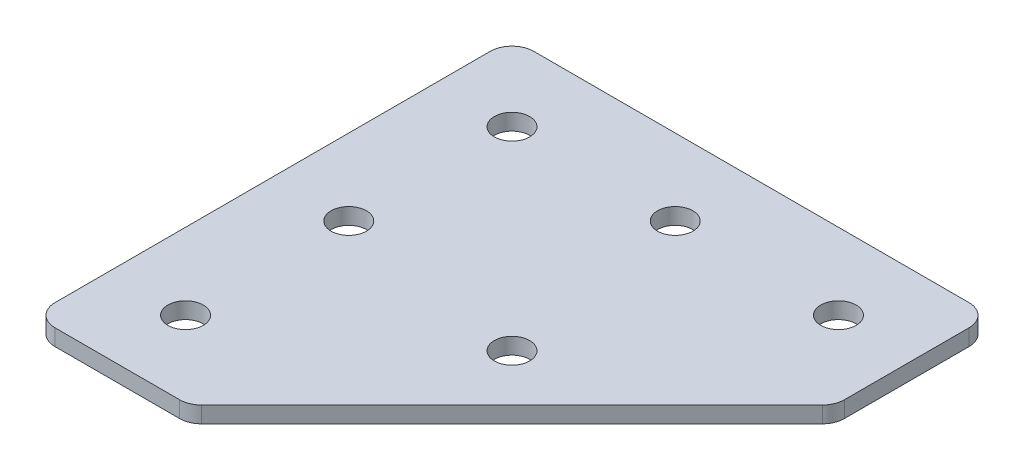
ISO-10303-21;
HEADER;
FILE_DESCRIPTION(('STEP AP214'),'2;1');
FILE_NAME('part.step','',(''),(''),'','','');
FILE_SCHEMA(('AUTOMOTIVE_DESIGN { 1 0 10303 214 1 1 1 1 }'));
ENDSEC;
DATA;
#1=APPLICATION_CONTEXT('core data for automotive mechanical design processes');
#2=APPLICATION_PROTOCOL_DEFINITION('international standard','automotive_design',2000,#1);
#3=PRODUCT_CONTEXT('',#1,'mechanical');
#4=PRODUCT('Part','Part','',(#3));
#5=PRODUCT_RELATED_PRODUCT_CATEGORY('part','',(#4));
#6=PRODUCT_DEFINITION_FORMATION('','',#4);
#7=PRODUCT_DEFINITION_CONTEXT('part definition',#1,'design');
#8=PRODUCT_DEFINITION('design','',#6,#7);
#9=PRODUCT_DEFINITION_SHAPE('','',#8);
#10=(LENGTH_UNIT() NAMED_UNIT(*) SI_UNIT(.MILLI.,.METRE.));
#11=(NAMED_UNIT(*) PLANE_ANGLE_UNIT() SI_UNIT($,.RADIAN.));
#12=(NAMED_UNIT(*) SI_UNIT($,.STERADIAN.) SOLID_ANGLE_UNIT());
#13=UNCERTAINTY_MEASURE_WITH_UNIT(LENGTH_MEASURE(1.E-05),#10,'distance_accuracy_value','');
#14=(GEOMETRIC_REPRESENTATION_CONTEXT(3) GLOBAL_UNCERTAINTY_ASSIGNED_CONTEXT((#13)) GLOBAL_UNIT_ASSIGNED_CONTEXT((#10,
#11,#12)) REPRESENTATION_CONTEXT('',''));
#15=CARTESIAN_POINT('',(0.,0.,0.));
#16=DIRECTION('',(0.,0.,1.));
#17=DIRECTION('',(1.,0.,0.));
#18=AXIS2_PLACEMENT_3D('',#15,#16,#17);
#19=CARTESIAN_POINT('',(-16.3452108311752,1.74134831028641,-16.1457325979904));
#20=DIRECTION('',(0.,-1.,0.));
#21=DIRECTION('',(0.,0.,-1.));
#22=AXIS2_PLACEMENT_3D('',#19,#20,#21);
#23=PLANE('',#22);
#24=CARTESIAN_POINT('',(1.48321629357095,1.74134831028641,1.68269452675578));
#25=DIRECTION('',(0.,1.,0.));
#26=DIRECTION('',(0.,0.,1.));
#27=AXIS2_PLACEMENT_3D('',#24,#25,#26);
#28=CIRCLE('',#27,1.625);
#29=CARTESIAN_POINT('',(1.48321629357095,1.74134831028641,3.30769452675578));
#30=VERTEX_POINT('',#29);
#31=EDGE_CURVE('E205',#30,#30,#28,.T.);
#32=ORIENTED_EDGE('',*,*,#31,.T.);
#33=EDGE_LOOP('',(#32));
#34=FACE_BOUND('',#33,.T.);
#35=CARTESIAN_POINT('',(13.6547891688248,1.74134831028641,-16.1457325979904));
#36=DIRECTION('',(0.,1.,0.));
#37=DIRECTION('',(0.,0.,1.));
#38=AXIS2_PLACEMENT_3D('',#35,#36,#37);
#39=CIRCLE('',#38,1.625);
#40=CARTESIAN_POINT('',(13.6547891688248,1.74134831028641,-14.5207325979904));
#41=VERTEX_POINT('',#40);
#42=EDGE_CURVE('E199',#41,#41,#39,.T.);
#43=ORIENTED_EDGE('',*,*,#42,.T.);
#44=EDGE_LOOP('',(#43));
#45=FACE_BOUND('',#44,.T.);
#46=CARTESIAN_POINT('',(-16.3452108311752,1.74134831028641,13.8542674020096));
#47=DIRECTION('',(0.,1.,0.));
#48=DIRECTION('',(0.,0.,1.));
#49=AXIS2_PLACEMENT_3D('',#46,#47,#48);
#50=CIRCLE('',#49,1.625);
#51=CARTESIAN_POINT('',(-16.3452108311752,1.74134831028641,15.4792674020096));
#52=VERTEX_POINT('',#51);
#53=EDGE_CURVE('E193',#52,#52,#50,.T.);
#54=ORIENTED_EDGE('',*,*,#53,.T.);
#55=EDGE_LOOP('',(#54));
#56=FACE_BOUND('',#55,.T.);
#57=CARTESIAN_POINT('',(-16.3452108311752,1.74134831028641,-1.14573259799041));
#58=DIRECTION('',(0.,1.,0.));
#59=DIRECTION('',(0.,0.,1.));
#60=AXIS2_PLACEMENT_3D('',#57,#58,#59);
#61=CIRCLE('',#60,1.625);
#62=CARTESIAN_POINT('',(-16.3452108311752,1.74134831028641,0.479267402009586));
#63=VERTEX_POINT('',#62);
#64=EDGE_CURVE('E187',#63,#63,#61,.T.);
#65=ORIENTED_EDGE('',*,*,#64,.T.);
#66=EDGE_LOOP('',(#65));
#67=FACE_BOUND('',#66,.T.);
#68=CARTESIAN_POINT('',(-1.34521083117524,1.74134831028641,-16.1457325979904));
#69=DIRECTION('',(0.,1.,0.));
#70=DIRECTION('',(0.,0.,1.));
#71=AXIS2_PLACEMENT_3D('',#68,#69,#70);
#72=CIRCLE('',#71,1.625);
#73=CARTESIAN_POINT('',(-1.34521083117524,1.74134831028641,-14.5207325979904));
#74=VERTEX_POINT('',#73);
#75=EDGE_CURVE('E181',#74,#74,#72,.T.);
#76=ORIENTED_EDGE('',*,*,#75,.T.);
#77=EDGE_LOOP('',(#76));
#78=FACE_BOUND('',#77,.T.);
#79=CARTESIAN_POINT('',(-16.3452108311752,1.74134831028641,-16.1457325979904));
#80=DIRECTION('',(0.,1.,0.));
#81=DIRECTION('',(0.,0.,1.));
#82=AXIS2_PLACEMENT_3D('',#79,#80,#81);
#83=CIRCLE('',#82,1.625);
#84=CARTESIAN_POINT('',(-16.3452108311752,1.74134831028641,-14.5207325979904));
#85=VERTEX_POINT('',#84);
#86=EDGE_CURVE('E168',#85,#85,#83,.T.);
#87=ORIENTED_EDGE('',*,*,#86,.T.);
#88=EDGE_LOOP('',(#87));
#89=FACE_BOUND('',#88,.T.);
#90=DIRECTION('',(0.,0.,-1.));
#91=VECTOR('',#90,1.);
#92=CARTESIAN_POINT('',(20.6547891688247,1.74134831028641,-8.85283937917692));
#93=LINE('',#92,#91);
#94=CARTESIAN_POINT('',(20.6547891688247,1.74134831028641,-9.68126650392311));
#95=VERTEX_POINT('',#94);
#96=CARTESIAN_POINT('',(20.6547891688247,1.74134831028641,-21.1457325979905));
#97=VERTEX_POINT('',#96);
#98=EDGE_CURVE('E116',#95,#97,#93,.T.);
#99=ORIENTED_EDGE('',*,*,#98,.F.);
#100=CARTESIAN_POINT('',(18.6547891688247,1.74134831028641,-9.68126650392311));
#101=DIRECTION('',(0.,-1.,0.));
#102=DIRECTION('',(0.,0.,-1.));
#103=AXIS2_PLACEMENT_3D('',#100,#101,#102);
#104=CIRCLE('',#103,2.);
#105=CARTESIAN_POINT('',(20.0690027311977,1.74134831028641,-8.26705294155001));
#106=VERTEX_POINT('',#105);
#107=EDGE_CURVE('E142',#95,#106,#104,.T.);
#108=ORIENTED_EDGE('',*,*,#107,.T.);
#109=DIRECTION('',(0.707106781186546,0.,-0.707106781186549));
#110=VECTOR('',#109,1.);
#111=CARTESIAN_POINT('',(-9.05231761236169,1.74134831028641,20.8542674020096));
#112=LINE('',#111,#110);
#113=CARTESIAN_POINT('',(-8.46653117473478,1.74134831028641,20.2684809643827));
#114=VERTEX_POINT('',#113);
#115=EDGE_CURVE('E121',#114,#106,#112,.T.);
#116=ORIENTED_EDGE('',*,*,#115,.F.);
#117=CARTESIAN_POINT('',(-9.88074473710788,1.74134831028641,18.8542674020096));
#118=DIRECTION('',(0.,-1.,0.));
#119=DIRECTION('',(0.,0.,-1.));
#120=AXIS2_PLACEMENT_3D('',#117,#118,#119);
#121=CIRCLE('',#120,2.);
#122=CARTESIAN_POINT('',(-9.88074473710788,1.74134831028641,20.8542674020096));
#123=VERTEX_POINT('',#122);
#124=EDGE_CURVE('E31',#114,#123,#121,.T.);
#125=ORIENTED_EDGE('',*,*,#124,.T.);
#126=DIRECTION('',(1.,0.,0.));
#127=VECTOR('',#126,1.);
#128=CARTESIAN_POINT('',(-23.3452108311753,1.74134831028641,20.8542674020096));
#129=LINE('',#128,#127);
#130=CARTESIAN_POINT('',(-21.3452108311753,1.74134831028641,20.8542674020096));
#131=VERTEX_POINT('',#130);
#132=EDGE_CURVE('E172',#131,#123,#129,.T.);
#133=ORIENTED_EDGE('',*,*,#132,.F.);
#134=CARTESIAN_POINT('',(-21.3452108311753,1.74134831028641,18.8542674020095));
#135=DIRECTION('',(0.,-1.,0.));
#136=DIRECTION('',(0.,0.,-1.));
#137=AXIS2_PLACEMENT_3D('',#134,#135,#136);
#138=CIRCLE('',#137,2.);
#139=CARTESIAN_POINT('',(-23.3452108311753,1.74134831028641,18.8542674020095));
#140=VERTEX_POINT('',#139);
#141=EDGE_CURVE('E135',#131,#140,#138,.T.);
#142=ORIENTED_EDGE('',*,*,#141,.T.);
#143=DIRECTION('',(0.,0.,1.));
#144=VECTOR('',#143,1.);
#145=CARTESIAN_POINT('',(-23.3452108311753,1.74134831028641,-23.1457325979905));
#146=LINE('',#145,#144);
#147=CARTESIAN_POINT('',(-23.3452108311753,1.74134831028641,-21.1457325979904));
#148=VERTEX_POINT('',#147);
#149=EDGE_CURVE('E161',#148,#140,#146,.T.);
#150=ORIENTED_EDGE('',*,*,#149,.F.);
#151=CARTESIAN_POINT('',(-21.3452108311753,1.74134831028641,-21.1457325979904));
#152=DIRECTION('',(0.,-1.,0.));
#153=DIRECTION('',(0.,0.,-1.));
#154=AXIS2_PLACEMENT_3D('',#151,#152,#153);
#155=CIRCLE('',#154,2.);
#156=CARTESIAN_POINT('',(-21.3452108311753,1.74134831028641,-23.1457325979905));
#157=VERTEX_POINT('',#156);
#158=EDGE_CURVE('E137',#148,#157,#155,.T.);
#159=ORIENTED_EDGE('',*,*,#158,.T.);
#160=DIRECTION('',(-1.,0.,0.));
#161=VECTOR('',#160,1.);
#162=CARTESIAN_POINT('',(20.6547891688247,1.74134831028641,-23.1457325979905));
#163=LINE('',#162,#161);
#164=CARTESIAN_POINT('',(18.6547891688247,1.74134831028641,-23.1457325979905));
#165=VERTEX_POINT('',#164);
#166=EDGE_CURVE('E175',#165,#157,#163,.T.);
#167=ORIENTED_EDGE('',*,*,#166,.F.);
#168=CARTESIAN_POINT('',(18.6547891688247,1.74134831028641,-21.1457325979905));
#169=DIRECTION('',(0.,-1.,0.));
#170=DIRECTION('',(0.,0.,-1.));
#171=AXIS2_PLACEMENT_3D('',#168,#169,#170);
#172=CIRCLE('',#171,2.);
#173=EDGE_CURVE('E139',#165,#97,#172,.T.);
#174=ORIENTED_EDGE('',*,*,#173,.T.);
#175=EDGE_LOOP('',(#99,#108,#116,#125,#133,#142,#150,#159,#167,#174));
#176=FACE_BOUND('',#175,.T.);
#177=ADVANCED_FACE('F16',(#34,#45,#56,#67,#78,#89,#176),#23,.T.);
#178=CARTESIAN_POINT('',(20.6547891688247,1.74134831028641,-23.1457325979905));
#179=DIRECTION('',(0.,0.,-1.));
#180=DIRECTION('',(-1.,0.,0.));
#181=AXIS2_PLACEMENT_3D('',#178,#179,#180);
#182=PLANE('',#181);
#183=DIRECTION('',(-1.,0.,0.));
#184=VECTOR('',#183,1.);
#185=CARTESIAN_POINT('',(20.6547891688247,3.24134831028641,-23.1457325979905));
#186=LINE('',#185,#184);
#187=CARTESIAN_POINT('',(18.6547891688247,3.24134831028641,-23.1457325979905));
#188=VERTEX_POINT('',#187);
#189=CARTESIAN_POINT('',(-21.3452108311753,3.24134831028641,-23.1457325979905));
#190=VERTEX_POINT('',#189);
#191=EDGE_CURVE('E165',#188,#190,#186,.T.);
#192=ORIENTED_EDGE('',*,*,#191,.F.);
#193=DIRECTION('',(0.,1.,0.));
#194=VECTOR('',#193,1.);
#195=CARTESIAN_POINT('',(18.6547891688247,1.74134831028641,-23.1457325979905));
#196=LINE('',#195,#194);
#197=EDGE_CURVE('E150',#188,#165,#196,.F.);
#198=ORIENTED_EDGE('',*,*,#197,.T.);
#199=ORIENTED_EDGE('',*,*,#166,.T.);
#200=DIRECTION('',(0.,1.,0.));
#201=VECTOR('',#200,1.);
#202=CARTESIAN_POINT('',(-21.3452108311753,1.74134831028641,-23.1457325979905));
#203=LINE('',#202,#201);
#204=EDGE_CURVE('E147',#157,#190,#203,.T.);
#205=ORIENTED_EDGE('',*,*,#204,.T.);
#206=EDGE_LOOP('',(#192,#198,#199,#205));
#207=FACE_BOUND('',#206,.T.);
#208=ADVANCED_FACE('F252',(#207),#182,.T.);
#209=CARTESIAN_POINT('',(20.6547891688247,1.74134831028641,-8.85283937917692));
#210=DIRECTION('',(1.,0.,0.));
#211=DIRECTION('',(0.,0.,-1.));
#212=AXIS2_PLACEMENT_3D('',#209,#210,#211);
#213=PLANE('',#212);
#214=DIRECTION('',(0.,0.,-1.));
#215=VECTOR('',#214,1.);
#216=CARTESIAN_POINT('',(20.6547891688247,3.24134831028641,-8.85283937917692));
#217=LINE('',#216,#215);
#218=CARTESIAN_POINT('',(20.6547891688247,3.24134831028641,-9.68126650392311));
#219=VERTEX_POINT('',#218);
#220=CARTESIAN_POINT('',(20.6547891688247,3.24134831028641,-21.1457325979905));
#221=VERTEX_POINT('',#220);
#222=EDGE_CURVE('E113',#219,#221,#217,.T.);
#223=ORIENTED_EDGE('',*,*,#222,.F.);
#224=DIRECTION('',(0.,1.,0.));
#225=VECTOR('',#224,1.);
#226=CARTESIAN_POINT('',(20.6547891688247,1.74134831028641,-9.68126650392311));
#227=LINE('',#226,#225);
#228=EDGE_CURVE('E133',#219,#95,#227,.F.);
#229=ORIENTED_EDGE('',*,*,#228,.T.);
#230=ORIENTED_EDGE('',*,*,#98,.T.);
#231=DIRECTION('',(0.,1.,0.));
#232=VECTOR('',#231,1.);
#233=CARTESIAN_POINT('',(20.6547891688247,1.74134831028641,-21.1457325979905));
#234=LINE('',#233,#232);
#235=EDGE_CURVE('E130',#97,#221,#234,.T.);
#236=ORIENTED_EDGE('',*,*,#235,.T.);
#237=EDGE_LOOP('',(#223,#229,#230,#236));
#238=FACE_BOUND('',#237,.T.);
#239=ADVANCED_FACE('F257',(#238),#213,.T.);
#240=CARTESIAN_POINT('',(-9.05231761236169,1.74134831028641,20.8542674020096));
#241=DIRECTION('',(0.707106781186549,0.,0.707106781186546));
#242=DIRECTION('',(0.707106781186546,0.,-0.707106781186549));
#243=AXIS2_PLACEMENT_3D('',#240,#241,#242);
#244=PLANE('',#243);
#245=ORIENTED_EDGE('',*,*,#115,.T.);
#246=DIRECTION('',(0.,1.,0.));
#247=VECTOR('',#246,1.);
#248=CARTESIAN_POINT('',(20.0690027311978,1.74134831028641,-8.26705294155002));
#249=LINE('',#248,#247);
#250=CARTESIAN_POINT('',(20.0690027311977,3.24134831028641,-8.26705294155001));
#251=VERTEX_POINT('',#250);
#252=EDGE_CURVE('E112',#106,#251,#249,.T.);
#253=ORIENTED_EDGE('',*,*,#252,.T.);
#254=DIRECTION('',(0.707106781186546,0.,-0.707106781186549));
#255=VECTOR('',#254,1.);
#256=CARTESIAN_POINT('',(-9.05231761236169,3.24134831028641,20.8542674020096));
#257=LINE('',#256,#255);
#258=CARTESIAN_POINT('',(-8.46653117473478,3.24134831028641,20.2684809643827));
#259=VERTEX_POINT('',#258);
#260=EDGE_CURVE('E97',#259,#251,#257,.T.);
#261=ORIENTED_EDGE('',*,*,#260,.F.);
#262=DIRECTION('',(0.,1.,0.));
#263=VECTOR('',#262,1.);
#264=CARTESIAN_POINT('',(-8.46653117473478,1.74134831028641,20.2684809643827));
#265=LINE('',#264,#263);
#266=EDGE_CURVE('E110',#259,#114,#265,.F.);
#267=ORIENTED_EDGE('',*,*,#266,.T.);
#268=EDGE_LOOP('',(#245,#253,#261,#267));
#269=FACE_BOUND('',#268,.T.);
#270=ADVANCED_FACE('F109',(#269),#244,.T.);
#271=CARTESIAN_POINT('',(-23.3452108311753,1.74134831028641,20.8542674020096));
#272=DIRECTION('',(0.,0.,1.));
#273=DIRECTION('',(1.,0.,0.));
#274=AXIS2_PLACEMENT_3D('',#271,#272,#273);
#275=PLANE('',#274);
#276=ORIENTED_EDGE('',*,*,#132,.T.);
#277=DIRECTION('',(0.,1.,0.));
#278=VECTOR('',#277,1.);
#279=CARTESIAN_POINT('',(-9.88074473710788,1.74134831028641,20.8542674020096));
#280=LINE('',#279,#278);
#281=CARTESIAN_POINT('',(-9.88074473710788,3.24134831028641,20.8542674020096));
#282=VERTEX_POINT('',#281);
#283=EDGE_CURVE('E145',#123,#282,#280,.T.);
#284=ORIENTED_EDGE('',*,*,#283,.T.);
#285=DIRECTION('',(1.,0.,0.));
#286=VECTOR('',#285,1.);
#287=CARTESIAN_POINT('',(-23.3452108311753,3.24134831028641,20.8542674020096));
#288=LINE('',#287,#286);
#289=CARTESIAN_POINT('',(-21.3452108311753,3.24134831028641,20.8542674020096));
#290=VERTEX_POINT('',#289);
#291=EDGE_CURVE('E98',#290,#282,#288,.T.);
#292=ORIENTED_EDGE('',*,*,#291,.F.);
#293=DIRECTION('',(0.,1.,0.));
#294=VECTOR('',#293,1.);
#295=CARTESIAN_POINT('',(-21.3452108311753,1.74134831028641,20.8542674020096));
#296=LINE('',#295,#294);
#297=EDGE_CURVE('E38',#290,#131,#296,.F.);
#298=ORIENTED_EDGE('',*,*,#297,.T.);
#299=EDGE_LOOP('',(#276,#284,#292,#298));
#300=FACE_BOUND('',#299,.T.);
#301=ADVANCED_FACE('F292',(#300),#275,.T.);
#302=CARTESIAN_POINT('',(-23.3452108311753,1.74134831028641,-23.1457325979905));
#303=DIRECTION('',(-1.,0.,0.));
#304=DIRECTION('',(0.,0.,1.));
#305=AXIS2_PLACEMENT_3D('',#302,#303,#304);
#306=PLANE('',#305);
#307=DIRECTION('',(0.,0.,1.));
#308=VECTOR('',#307,1.);
#309=CARTESIAN_POINT('',(-23.3452108311753,3.24134831028641,-23.1457325979905));
#310=LINE('',#309,#308);
#311=CARTESIAN_POINT('',(-23.3452108311753,3.24134831028641,-21.1457325979904));
#312=VERTEX_POINT('',#311);
#313=CARTESIAN_POINT('',(-23.3452108311753,3.24134831028641,18.8542674020095));
#314=VERTEX_POINT('',#313);
#315=EDGE_CURVE('E158',#312,#314,#310,.T.);
#316=ORIENTED_EDGE('',*,*,#315,.F.);
#317=DIRECTION('',(0.,1.,0.));
#318=VECTOR('',#317,1.);
#319=CARTESIAN_POINT('',(-23.3452108311753,1.74134831028641,-21.1457325979904));
#320=LINE('',#319,#318);
#321=EDGE_CURVE('E10',#312,#148,#320,.F.);
#322=ORIENTED_EDGE('',*,*,#321,.T.);
#323=ORIENTED_EDGE('',*,*,#149,.T.);
#324=DIRECTION('',(0.,1.,0.));
#325=VECTOR('',#324,1.);
#326=CARTESIAN_POINT('',(-23.3452108311753,1.74134831028641,18.8542674020095));
#327=LINE('',#326,#325);
#328=EDGE_CURVE('E24',#140,#314,#327,.T.);
#329=ORIENTED_EDGE('',*,*,#328,.T.);
#330=EDGE_LOOP('',(#316,#322,#323,#329));
#331=FACE_BOUND('',#330,.T.);
#332=ADVANCED_FACE('F157',(#331),#306,.T.);
#333=CARTESIAN_POINT('',(-16.3452108311752,3.24134831028641,-16.1457325979904));
#334=DIRECTION('',(0.,-1.,0.));
#335=DIRECTION('',(0.,0.,-1.));
#336=AXIS2_PLACEMENT_3D('',#333,#334,#335);
#337=PLANE('',#336);
#338=CARTESIAN_POINT('',(1.48321629357095,3.24134831028641,1.68269452675578));
#339=DIRECTION('',(0.,1.,0.));
#340=DIRECTION('',(0.,0.,1.));
#341=AXIS2_PLACEMENT_3D('',#338,#339,#340);
#342=CIRCLE('',#341,1.625);
#343=CARTESIAN_POINT('',(1.48321629357095,3.24134831028641,3.30769452675578));
#344=VERTEX_POINT('',#343);
#345=EDGE_CURVE('E208',#344,#344,#342,.T.);
#346=ORIENTED_EDGE('',*,*,#345,.F.);
#347=EDGE_LOOP('',(#346));
#348=FACE_BOUND('',#347,.T.);
#349=CARTESIAN_POINT('',(13.6547891688248,3.24134831028641,-16.1457325979904));
#350=DIRECTION('',(0.,1.,0.));
#351=DIRECTION('',(0.,0.,1.));
#352=AXIS2_PLACEMENT_3D('',#349,#350,#351);
#353=CIRCLE('',#352,1.625);
#354=CARTESIAN_POINT('',(13.6547891688248,3.24134831028641,-14.5207325979904));
#355=VERTEX_POINT('',#354);
#356=EDGE_CURVE('E202',#355,#355,#353,.T.);
#357=ORIENTED_EDGE('',*,*,#356,.F.);
#358=EDGE_LOOP('',(#357));
#359=FACE_BOUND('',#358,.T.);
#360=CARTESIAN_POINT('',(-16.3452108311752,3.24134831028641,13.8542674020096));
#361=DIRECTION('',(0.,1.,0.));
#362=DIRECTION('',(0.,0.,1.));
#363=AXIS2_PLACEMENT_3D('',#360,#361,#362);
#364=CIRCLE('',#363,1.625);
#365=CARTESIAN_POINT('',(-16.3452108311752,3.24134831028641,15.4792674020096));
#366=VERTEX_POINT('',#365);
#367=EDGE_CURVE('E196',#366,#366,#364,.T.);
#368=ORIENTED_EDGE('',*,*,#367,.F.);
#369=EDGE_LOOP('',(#368));
#370=FACE_BOUND('',#369,.T.);
#371=CARTESIAN_POINT('',(-16.3452108311752,3.24134831028641,-1.14573259799041));
#372=DIRECTION('',(0.,1.,0.));
#373=DIRECTION('',(0.,0.,1.));
#374=AXIS2_PLACEMENT_3D('',#371,#372,#373);
#375=CIRCLE('',#374,1.625);
#376=CARTESIAN_POINT('',(-16.3452108311752,3.24134831028641,0.479267402009586));
#377=VERTEX_POINT('',#376);
#378=EDGE_CURVE('E190',#377,#377,#375,.T.);
#379=ORIENTED_EDGE('',*,*,#378,.F.);
#380=EDGE_LOOP('',(#379));
#381=FACE_BOUND('',#380,.T.);
#382=CARTESIAN_POINT('',(-1.34521083117524,3.24134831028641,-16.1457325979904));
#383=DIRECTION('',(0.,1.,0.));
#384=DIRECTION('',(0.,0.,1.));
#385=AXIS2_PLACEMENT_3D('',#382,#383,#384);
#386=CIRCLE('',#385,1.625);
#387=CARTESIAN_POINT('',(-1.34521083117524,3.24134831028641,-14.5207325979904));
#388=VERTEX_POINT('',#387);
#389=EDGE_CURVE('E184',#388,#388,#386,.T.);
#390=ORIENTED_EDGE('',*,*,#389,.F.);
#391=EDGE_LOOP('',(#390));
#392=FACE_BOUND('',#391,.T.);
#393=CARTESIAN_POINT('',(-16.3452108311752,3.24134831028641,-16.1457325979904));
#394=DIRECTION('',(0.,1.,0.));
#395=DIRECTION('',(0.,0.,1.));
#396=AXIS2_PLACEMENT_3D('',#393,#394,#395);
#397=CIRCLE('',#396,1.625);
#398=CARTESIAN_POINT('',(-16.3452108311752,3.24134831028641,-14.5207325979904));
#399=VERTEX_POINT('',#398);
#400=EDGE_CURVE('E178',#399,#399,#397,.T.);
#401=ORIENTED_EDGE('',*,*,#400,.F.);
#402=EDGE_LOOP('',(#401));
#403=FACE_BOUND('',#402,.T.);
#404=ORIENTED_EDGE('',*,*,#260,.T.);
#405=CARTESIAN_POINT('',(18.6547891688247,3.24134831028641,-9.68126650392311));
#406=DIRECTION('',(0.,-1.,0.));
#407=DIRECTION('',(0.,0.,-1.));
#408=AXIS2_PLACEMENT_3D('',#405,#406,#407);
#409=CIRCLE('',#408,2.);
#410=EDGE_CURVE('E103',#251,#219,#409,.F.);
#411=ORIENTED_EDGE('',*,*,#410,.T.);
#412=ORIENTED_EDGE('',*,*,#222,.T.);
#413=CARTESIAN_POINT('',(18.6547891688247,3.24134831028641,-21.1457325979905));
#414=DIRECTION('',(0.,-1.,0.));
#415=DIRECTION('',(0.,0.,-1.));
#416=AXIS2_PLACEMENT_3D('',#413,#414,#415);
#417=CIRCLE('',#416,2.);
#418=EDGE_CURVE('E104',#221,#188,#417,.F.);
#419=ORIENTED_EDGE('',*,*,#418,.T.);
#420=ORIENTED_EDGE('',*,*,#191,.T.);
#421=CARTESIAN_POINT('',(-21.3452108311753,3.24134831028641,-21.1457325979904));
#422=DIRECTION('',(0.,-1.,0.));
#423=DIRECTION('',(0.,0.,-1.));
#424=AXIS2_PLACEMENT_3D('',#421,#422,#423);
#425=CIRCLE('',#424,2.);
#426=EDGE_CURVE('E126',#190,#312,#425,.F.);
#427=ORIENTED_EDGE('',*,*,#426,.T.);
#428=ORIENTED_EDGE('',*,*,#315,.T.);
#429=CARTESIAN_POINT('',(-21.3452108311753,3.24134831028641,18.8542674020095));
#430=DIRECTION('',(0.,-1.,0.));
#431=DIRECTION('',(0.,0.,-1.));
#432=AXIS2_PLACEMENT_3D('',#429,#430,#431);
#433=CIRCLE('',#432,2.);
#434=EDGE_CURVE('E118',#314,#290,#433,.F.);
#435=ORIENTED_EDGE('',*,*,#434,.T.);
#436=ORIENTED_EDGE('',*,*,#291,.T.);
#437=CARTESIAN_POINT('',(-9.88074473710788,3.24134831028641,18.8542674020096));
#438=DIRECTION('',(0.,-1.,0.));
#439=DIRECTION('',(0.,0.,-1.));
#440=AXIS2_PLACEMENT_3D('',#437,#438,#439);
#441=CIRCLE('',#440,2.);
#442=EDGE_CURVE('E94',#282,#259,#441,.F.);
#443=ORIENTED_EDGE('',*,*,#442,.T.);
#444=EDGE_LOOP('',(#404,#411,#412,#419,#420,#427,#428,#435,#436,#443));
#445=FACE_BOUND('',#444,.T.);
#446=ADVANCED_FACE('F96',(#348,#359,#370,#381,#392,#403,#445),#337,.F.);
#447=CARTESIAN_POINT('',(-16.3452108311752,1.74134831028641,-16.1457325979904));
#448=DIRECTION('',(0.,1.,0.));
#449=DIRECTION('',(0.,0.,1.));
#450=AXIS2_PLACEMENT_3D('',#447,#448,#449);
#451=CYLINDRICAL_SURFACE('',#450,1.625);
#452=ORIENTED_EDGE('',*,*,#86,.F.);
#453=EDGE_LOOP('',(#452));
#454=FACE_BOUND('',#453,.T.);
#455=ORIENTED_EDGE('',*,*,#400,.T.);
#456=EDGE_LOOP('',(#455));
#457=FACE_BOUND('',#456,.T.);
#458=ADVANCED_FACE('F226',(#454,#457),#451,.F.);
#459=CARTESIAN_POINT('',(-1.34521083117524,1.74134831028641,-16.1457325979904));
#460=DIRECTION('',(0.,1.,0.));
#461=DIRECTION('',(0.,0.,1.));
#462=AXIS2_PLACEMENT_3D('',#459,#460,#461);
#463=CYLINDRICAL_SURFACE('',#462,1.625);
#464=ORIENTED_EDGE('',*,*,#75,.F.);
#465=EDGE_LOOP('',(#464));
#466=FACE_BOUND('',#465,.T.);
#467=ORIENTED_EDGE('',*,*,#389,.T.);
#468=EDGE_LOOP('',(#467));
#469=FACE_BOUND('',#468,.T.);
#470=ADVANCED_FACE('F239',(#466,#469),#463,.F.);
#471=CARTESIAN_POINT('',(-16.3452108311752,1.74134831028641,-1.14573259799041));
#472=DIRECTION('',(0.,1.,0.));
#473=DIRECTION('',(0.,0.,1.));
#474=AXIS2_PLACEMENT_3D('',#471,#472,#473);
#475=CYLINDRICAL_SURFACE('',#474,1.625);
#476=ORIENTED_EDGE('',*,*,#64,.F.);
#477=EDGE_LOOP('',(#476));
#478=FACE_BOUND('',#477,.T.);
#479=ORIENTED_EDGE('',*,*,#378,.T.);
#480=EDGE_LOOP('',(#479));
#481=FACE_BOUND('',#480,.T.);
#482=ADVANCED_FACE('F246',(#478,#481),#475,.F.);
#483=CARTESIAN_POINT('',(-16.3452108311752,1.74134831028641,13.8542674020096));
#484=DIRECTION('',(0.,1.,0.));
#485=DIRECTION('',(0.,0.,1.));
#486=AXIS2_PLACEMENT_3D('',#483,#484,#485);
#487=CYLINDRICAL_SURFACE('',#486,1.625);
#488=ORIENTED_EDGE('',*,*,#53,.F.);
#489=EDGE_LOOP('',(#488));
#490=FACE_BOUND('',#489,.T.);
#491=ORIENTED_EDGE('',*,*,#367,.T.);
#492=EDGE_LOOP('',(#491));
#493=FACE_BOUND('',#492,.T.);
#494=ADVANCED_FACE('F330',(#490,#493),#487,.F.);
#495=CARTESIAN_POINT('',(13.6547891688248,1.74134831028641,-16.1457325979904));
#496=DIRECTION('',(0.,1.,0.));
#497=DIRECTION('',(0.,0.,1.));
#498=AXIS2_PLACEMENT_3D('',#495,#496,#497);
#499=CYLINDRICAL_SURFACE('',#498,1.625);
#500=ORIENTED_EDGE('',*,*,#42,.F.);
#501=EDGE_LOOP('',(#500));
#502=FACE_BOUND('',#501,.T.);
#503=ORIENTED_EDGE('',*,*,#356,.T.);
#504=EDGE_LOOP('',(#503));
#505=FACE_BOUND('',#504,.T.);
#506=ADVANCED_FACE('F220',(#502,#505),#499,.F.);
#507=CARTESIAN_POINT('',(1.48321629357095,1.74134831028641,1.68269452675578));
#508=DIRECTION('',(0.,1.,0.));
#509=DIRECTION('',(0.,0.,1.));
#510=AXIS2_PLACEMENT_3D('',#507,#508,#509);
#511=CYLINDRICAL_SURFACE('',#510,1.625);
#512=ORIENTED_EDGE('',*,*,#31,.F.);
#513=EDGE_LOOP('',(#512));
#514=FACE_BOUND('',#513,.T.);
#515=ORIENTED_EDGE('',*,*,#345,.T.);
#516=EDGE_LOOP('',(#515));
#517=FACE_BOUND('',#516,.T.);
#518=ADVANCED_FACE('F216',(#514,#517),#511,.F.);
#519=CARTESIAN_POINT('',(18.6547891688247,1.74134831028641,-9.68126650392311));
#520=DIRECTION('',(0.,1.,0.));
#521=DIRECTION('',(0.,0.,1.));
#522=AXIS2_PLACEMENT_3D('',#519,#520,#521);
#523=CYLINDRICAL_SURFACE('',#522,2.);
#524=ORIENTED_EDGE('',*,*,#107,.F.);
#525=ORIENTED_EDGE('',*,*,#228,.F.);
#526=ORIENTED_EDGE('',*,*,#410,.F.);
#527=ORIENTED_EDGE('',*,*,#252,.F.);
#528=EDGE_LOOP('',(#524,#525,#526,#527));
#529=FACE_BOUND('',#528,.T.);
#530=ADVANCED_FACE('F219',(#529),#523,.T.);
#531=CARTESIAN_POINT('',(-9.88074473710788,1.74134831028641,18.8542674020096));
#532=DIRECTION('',(0.,1.,0.));
#533=DIRECTION('',(0.,0.,1.));
#534=AXIS2_PLACEMENT_3D('',#531,#532,#533);
#535=CYLINDRICAL_SURFACE('',#534,2.);
#536=ORIENTED_EDGE('',*,*,#124,.F.);
#537=ORIENTED_EDGE('',*,*,#266,.F.);
#538=ORIENTED_EDGE('',*,*,#442,.F.);
#539=ORIENTED_EDGE('',*,*,#283,.F.);
#540=EDGE_LOOP('',(#536,#537,#538,#539));
#541=FACE_BOUND('',#540,.T.);
#542=ADVANCED_FACE('F115',(#541),#535,.T.);
#543=CARTESIAN_POINT('',(18.6547891688247,1.74134831028641,-21.1457325979905));
#544=DIRECTION('',(0.,1.,0.));
#545=DIRECTION('',(0.,0.,1.));
#546=AXIS2_PLACEMENT_3D('',#543,#544,#545);
#547=CYLINDRICAL_SURFACE('',#546,2.);
#548=ORIENTED_EDGE('',*,*,#173,.F.);
#549=ORIENTED_EDGE('',*,*,#197,.F.);
#550=ORIENTED_EDGE('',*,*,#418,.F.);
#551=ORIENTED_EDGE('',*,*,#235,.F.);
#552=EDGE_LOOP('',(#548,#549,#550,#551));
#553=FACE_BOUND('',#552,.T.);
#554=ADVANCED_FACE('F266',(#553),#547,.T.);
#555=CARTESIAN_POINT('',(-21.3452108311753,1.74134831028641,-21.1457325979904));
#556=DIRECTION('',(0.,1.,0.));
#557=DIRECTION('',(0.,0.,1.));
#558=AXIS2_PLACEMENT_3D('',#555,#556,#557);
#559=CYLINDRICAL_SURFACE('',#558,2.);
#560=ORIENTED_EDGE('',*,*,#158,.F.);
#561=ORIENTED_EDGE('',*,*,#321,.F.);
#562=ORIENTED_EDGE('',*,*,#426,.F.);
#563=ORIENTED_EDGE('',*,*,#204,.F.);
#564=EDGE_LOOP('',(#560,#561,#562,#563));
#565=FACE_BOUND('',#564,.T.);
#566=ADVANCED_FACE('F268',(#565),#559,.T.);
#567=CARTESIAN_POINT('',(-21.3452108311753,1.74134831028641,18.8542674020095));
#568=DIRECTION('',(0.,1.,0.));
#569=DIRECTION('',(0.,0.,1.));
#570=AXIS2_PLACEMENT_3D('',#567,#568,#569);
#571=CYLINDRICAL_SURFACE('',#570,2.);
#572=ORIENTED_EDGE('',*,*,#141,.F.);
#573=ORIENTED_EDGE('',*,*,#297,.F.);
#574=ORIENTED_EDGE('',*,*,#434,.F.);
#575=ORIENTED_EDGE('',*,*,#328,.F.);
#576=EDGE_LOOP('',(#572,#573,#574,#575));
#577=FACE_BOUND('',#576,.T.);
#578=ADVANCED_FACE('F18',(#577),#571,.T.);
#579=CLOSED_SHELL('',(#177,#208,#239,#270,#301,#332,#446,#458,#470,#482,#494,#506,#518,#530,
#542,#554,#566,#578));
#580=MANIFOLD_SOLID_BREP('B1',#579);
#581=ADVANCED_BREP_SHAPE_REPRESENTATION('',(#18,#580),#14);
#582=SHAPE_DEFINITION_REPRESENTATION(#9,#581);
ENDSEC;
END-ISO-10303-21;
